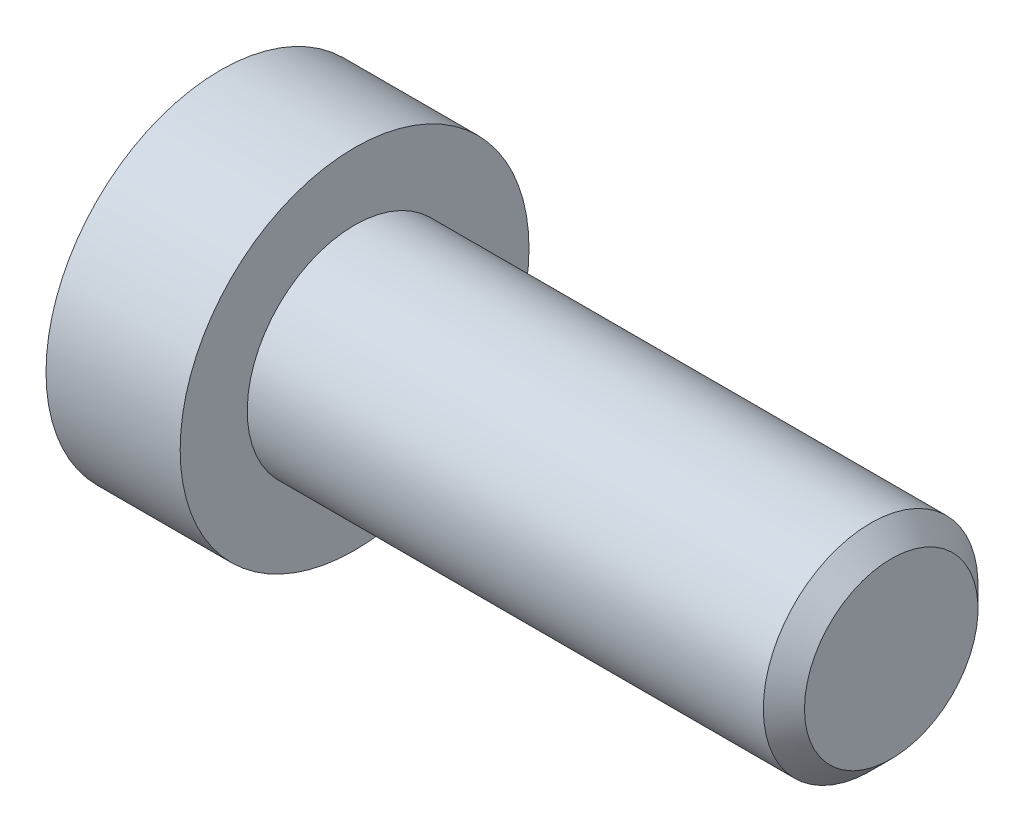
ISO-10303-21;
HEADER;
FILE_DESCRIPTION(('STEP AP214'),'2;1');
FILE_NAME('part.step','',(''),(''),'','','');
FILE_SCHEMA(('AUTOMOTIVE_DESIGN { 1 0 10303 214 1 1 1 1 }'));
ENDSEC;
DATA;
#1=APPLICATION_CONTEXT('core data for automotive mechanical design processes');
#2=APPLICATION_PROTOCOL_DEFINITION('international standard','automotive_design',2000,#1);
#3=PRODUCT_CONTEXT('',#1,'mechanical');
#4=PRODUCT('Part','Part','',(#3));
#5=PRODUCT_RELATED_PRODUCT_CATEGORY('part','',(#4));
#6=PRODUCT_DEFINITION_FORMATION('','',#4);
#7=PRODUCT_DEFINITION_CONTEXT('part definition',#1,'design');
#8=PRODUCT_DEFINITION('design','',#6,#7);
#9=PRODUCT_DEFINITION_SHAPE('','',#8);
#10=(LENGTH_UNIT() NAMED_UNIT(*) SI_UNIT(.MILLI.,.METRE.));
#11=(NAMED_UNIT(*) PLANE_ANGLE_UNIT() SI_UNIT($,.RADIAN.));
#12=(NAMED_UNIT(*) SI_UNIT($,.STERADIAN.) SOLID_ANGLE_UNIT());
#13=UNCERTAINTY_MEASURE_WITH_UNIT(LENGTH_MEASURE(1.E-05),#10,'distance_accuracy_value','');
#14=(GEOMETRIC_REPRESENTATION_CONTEXT(3) GLOBAL_UNCERTAINTY_ASSIGNED_CONTEXT((#13)) GLOBAL_UNIT_ASSIGNED_CONTEXT((#10,
#11,#12)) REPRESENTATION_CONTEXT('',''));
#15=CARTESIAN_POINT('',(0.,0.,0.));
#16=DIRECTION('',(0.,0.,1.));
#17=DIRECTION('',(1.,0.,0.));
#18=AXIS2_PLACEMENT_3D('',#15,#16,#17);
#19=CARTESIAN_POINT('',(1.4999999988845,0.,0.));
#20=DIRECTION('',(-1.,0.,0.));
#21=DIRECTION('',(0.,0.,1.));
#22=AXIS2_PLACEMENT_3D('',#19,#20,#21);
#23=CONICAL_SURFACE('',#22,1.9999999991569,1.04719754988149);
#24=CARTESIAN_POINT('',(2.65470054000616,-1.13686837721616E-10,0.));
#25=VERTEX_POINT('',#24);
#26=VERTEX_LOOP('',#25);
#27=FACE_BOUND('',#26,.T.);
#28=CARTESIAN_POINT('',(1.50000000000001,0.,0.));
#29=DIRECTION('',(1.,0.,0.));
#30=DIRECTION('',(0.,1.,0.));
#31=AXIS2_PLACEMENT_3D('',#28,#29,#30);
#32=CIRCLE('',#31,2.);
#33=CARTESIAN_POINT('',(1.50000000000001,2.,0.));
#34=VERTEX_POINT('',#33);
#35=EDGE_CURVE('E102',#34,#34,#32,.F.);
#36=ORIENTED_EDGE('',*,*,#35,.T.);
#37=EDGE_LOOP('',(#36));
#38=FACE_BOUND('',#37,.T.);
#39=ADVANCED_FACE('F15',(#27,#38),#23,.F.);
#40=CARTESIAN_POINT('',(0.172649730810379,0.,0.));
#41=DIRECTION('',(1.,0.,0.));
#42=DIRECTION('',(0.,1.,0.));
#43=AXIS2_PLACEMENT_3D('',#40,#41,#42);
#44=CYLINDRICAL_SURFACE('',#43,2.);
#45=ORIENTED_EDGE('',*,*,#35,.F.);
#46=EDGE_LOOP('',(#45));
#47=FACE_BOUND('',#46,.T.);
#48=CARTESIAN_POINT('',(-1.15470053748368,0.,0.));
#49=DIRECTION('',(-1.,0.,0.));
#50=DIRECTION('',(0.,1.,0.));
#51=AXIS2_PLACEMENT_3D('',#48,#49,#50);
#52=CIRCLE('',#51,2.0000000004643);
#53=CARTESIAN_POINT('',(-1.15470053748368,2.0000000004643,0.));
#54=VERTEX_POINT('',#53);
#55=EDGE_CURVE('E83',#54,#54,#52,.T.);
#56=ORIENTED_EDGE('',*,*,#55,.T.);
#57=EDGE_LOOP('',(#56));
#58=FACE_BOUND('',#57,.T.);
#59=ADVANCED_FACE('F152',(#47,#58),#44,.F.);
#60=CARTESIAN_POINT('',(-2.00507179761189,0.,0.));
#61=DIRECTION('',(-1.,0.,0.));
#62=DIRECTION('',(0.,0.,1.));
#63=AXIS2_PLACEMENT_3D('',#60,#61,#62);
#64=CONICAL_SURFACE('',#63,3.47288622424458,1.04719755000354);
#65=ORIENTED_EDGE('',*,*,#55,.F.);
#66=EDGE_LOOP('',(#65));
#67=FACE_BOUND('',#66,.T.);
#68=CARTESIAN_POINT('',(-2.00000000094557,3.00000000021538,1.73205080729591));
#69=CARTESIAN_POINT('',(-1.9560433185987,3.00000000007736,1.57982452062542));
#70=CARTESIAN_POINT('',(-1.91606701648317,3.00000000002074,1.42628421881986));
#71=CARTESIAN_POINT('',(-1.84628958176838,2.99999999997923,1.11654516758433));
#72=CARTESIAN_POINT('',(-1.81651313108637,2.9999999999945,0.960340916482288));
#73=CARTESIAN_POINT('',(-1.77016393888024,3.00000000000537,0.649868175264092));
#74=CARTESIAN_POINT('',(-1.75328268182428,3.00000000000144,0.495647441977665));
#75=CARTESIAN_POINT('',(-1.73313375260222,2.99999999999858,0.186480694490325));
#76=CARTESIAN_POINT('',(-1.72984939137745,2.99999999999965,0.0315358032554302));
#77=CARTESIAN_POINT('',(-1.73669943570568,3.00000000000032,-0.257962103818241));
#78=CARTESIAN_POINT('',(-1.74515192833178,3.00000000000009,-0.392558561177158));
#79=CARTESIAN_POINT('',(-1.77193595166592,2.99999999999992,-0.660874623875168));
#80=CARTESIAN_POINT('',(-1.79027662278917,2.99999999999998,-0.794593301873308));
#81=CARTESIAN_POINT('',(-1.83612475075242,3.00000000000003,-1.06346212096512));
#82=CARTESIAN_POINT('',(-1.86382646413472,3.00000000000002,-1.19857825024739));
#83=CARTESIAN_POINT('',(-1.92669764219973,2.99999999999999,-1.46679583459464));
#84=CARTESIAN_POINT('',(-1.96185234414,2.99999999999998,-1.59990072318624));
#85=CARTESIAN_POINT('',(-2.00000000108562,3.00000000000001,-1.7320508072926));
#86=B_SPLINE_CURVE_WITH_KNOTS('',3,(#68,#69,#70,#71,#72,#73,#74,#75,#76,#77,#78,#79,#80,#81,#82,
#83,#84,#85),.UNSPECIFIED.,.F.,.F.,(4,2,2,2,2,2,2,2,4),(0.,0.475524017494202,0.952190725870323,
1.41706140966825,1.88136133388909,2.28556167425684,2.69013629076999,3.10368243361385,
3.51641695995043),.UNSPECIFIED.);
#87=CARTESIAN_POINT('',(-2.00000000107572,2.99999999986554,1.73205080749124));
#88=VERTEX_POINT('',#87);
#89=CARTESIAN_POINT('',(-2.00000000112055,3.,-1.73205080741361));
#90=VERTEX_POINT('',#89);
#91=EDGE_CURVE('E18',#88,#90,#86,.T.);
#92=ORIENTED_EDGE('',*,*,#91,.T.);
#93=CARTESIAN_POINT('',(-2.00000000094557,2.99999999987129,-1.73205080789188));
#94=CARTESIAN_POINT('',(-1.9560433185987,2.86816816842187,-1.80816395110759));
#95=CARTESIAN_POINT('',(-1.91606701648317,2.73519836652522,-1.88493410196134));
#96=CARTESIAN_POINT('',(-1.84628958176838,2.4669564795904,-2.03980362754315));
#97=CARTESIAN_POINT('',(-1.81651313108636,2.33167962996455,-2.11790575310741));
#98=CARTESIAN_POINT('',(-1.77016393888024,2.06280234889243,-2.27314212372592));
#99=CARTESIAN_POINT('',(-1.75328268182428,1.92924327607415,-2.35025249036572));
#100=CARTESIAN_POINT('',(-1.73313375260221,1.66149701874328,-2.50483586410692));
#101=CARTESIAN_POINT('',(-1.72984939137744,1.52731080674778,-2.58230830972529));
#102=CARTESIAN_POINT('',(-1.73669943570568,1.27659826487989,-2.7270572632627));
#103=CARTESIAN_POINT('',(-1.74515192833178,1.16003431354756,-2.79435549194197));
#104=CARTESIAN_POINT('',(-1.77193595166592,0.927665787007584,-2.92851352329083));
#105=CARTESIAN_POINT('',(-1.79027662278917,0.811862014900753,-2.99537286228995));
#106=CARTESIAN_POINT('',(-1.83612475075242,0.579014787281745,-3.1298072718359));
#107=CARTESIAN_POINT('',(-1.86382646413472,0.462000786862266,-3.19736533647702));
#108=CARTESIAN_POINT('',(-1.92669764219973,0.229717545075842,-3.33147412865063));
#109=CARTESIAN_POINT('',(-1.96185234414,0.114445330187611,-3.39802657294642));
#110=CARTESIAN_POINT('',(-2.00000000108561,2.3927004015334E-10,-3.46410161499961));
#111=B_SPLINE_CURVE_WITH_KNOTS('',3,(#93,#94,#95,#96,#97,#98,#99,#100,#101,#102,#103,#104,#105,
#106,#107,#108,#109,#110),.UNSPECIFIED.,.F.,.F.,(4,2,2,2,2,2,2,2,4),(0.,0.475524017494201,
0.952190725870324,1.41706140966825,1.88136133388909,2.28556167425684,2.69013629076999,
3.10368243361386,3.51641695995044),.UNSPECIFIED.);
#112=CARTESIAN_POINT('',(-2.00000000107572,0.,-3.46410161498249));
#113=VERTEX_POINT('',#112);
#114=EDGE_CURVE('E107',#90,#113,#111,.T.);
#115=ORIENTED_EDGE('',*,*,#114,.T.);
#116=CARTESIAN_POINT('',(-2.00000000094557,-3.44076775434898E-10,-3.46410161518779));
#117=CARTESIAN_POINT('',(-1.9560433185987,-0.131831831655481,-3.38798847173302));
#118=CARTESIAN_POINT('',(-1.91606701648317,-0.264801633495514,-3.31121832078121));
#119=CARTESIAN_POINT('',(-1.84628958176838,-0.533043520388816,-3.15634879512749));
#120=CARTESIAN_POINT('',(-1.81651313108636,-0.668320370029949,-3.0782466695897));
#121=CARTESIAN_POINT('',(-1.77016393888024,-0.937197651112932,-2.92301029899001));
#122=CARTESIAN_POINT('',(-1.75328268182428,-1.07075672392727,-2.84589993234339));
#123=CARTESIAN_POINT('',(-1.73313375260221,-1.33850298125529,-2.69131655859725));
#124=CARTESIAN_POINT('',(-1.72984939137744,-1.47268919325186,-2.61384411298073));
#125=CARTESIAN_POINT('',(-1.73669943570568,-1.72340173512042,-2.46909515944447));
#126=CARTESIAN_POINT('',(-1.74515192833178,-1.83996568645252,-2.40179693076482));
#127=CARTESIAN_POINT('',(-1.77193595166592,-2.07233421299233,-2.26763889941566));
#128=CARTESIAN_POINT('',(-1.79027662278916,-2.18813798509922,-2.20077956041665));
#129=CARTESIAN_POINT('',(-1.83612475075242,-2.42098521271828,-2.06634515087078));
#130=CARTESIAN_POINT('',(-1.86382646413472,-2.53799921313775,-1.99878708622963));
#131=CARTESIAN_POINT('',(-1.92669764219973,-2.77028245492415,-1.86467829405599));
#132=CARTESIAN_POINT('',(-1.96185234414,-2.88555466981237,-1.79812584976018));
#133=CARTESIAN_POINT('',(-2.00000000108561,-2.99999999976073,-1.73205080770702));
#134=B_SPLINE_CURVE_WITH_KNOTS('',3,(#116,#117,#118,#119,#120,#121,#122,#123,#124,#125,#126,
#127,#128,#129,#130,#131,#132,#133),.UNSPECIFIED.,.F.,.F.,(4,2,2,2,2,2,2,2,4),(0.,
0.475524017494202,0.952190725870323,1.41706140966825,1.88136133388909,2.28556167425684,
2.69013629076999,3.10368243361386,3.51641695995044),.UNSPECIFIED.);
#135=CARTESIAN_POINT('',(-2.00000000107572,-2.99999999986553,-1.73205080749124));
#136=VERTEX_POINT('',#135);
#137=EDGE_CURVE('E141',#113,#136,#134,.T.);
#138=ORIENTED_EDGE('',*,*,#137,.T.);
#139=CARTESIAN_POINT('',(-2.00000000094557,-3.00000000021537,-1.73205080729591));
#140=CARTESIAN_POINT('',(-1.9560433185987,-3.00000000007735,-1.57982452062543));
#141=CARTESIAN_POINT('',(-1.91606701648317,-3.00000000002073,-1.42628421881987));
#142=CARTESIAN_POINT('',(-1.84628958176838,-2.99999999997922,-1.11654516758434));
#143=CARTESIAN_POINT('',(-1.81651313108636,-2.9999999999945,-0.960340916482298));
#144=CARTESIAN_POINT('',(-1.77016393888024,-3.00000000000537,-0.649868175264101));
#145=CARTESIAN_POINT('',(-1.75328268182428,-3.00000000000143,-0.495647441977675));
#146=CARTESIAN_POINT('',(-1.73313375260221,-2.99999999999857,-0.186480694490335));
#147=CARTESIAN_POINT('',(-1.72984939137744,-2.99999999999964,-0.0315358032554405));
#148=CARTESIAN_POINT('',(-1.73669943570568,-3.00000000000031,0.257962103818231));
#149=CARTESIAN_POINT('',(-1.74515192833178,-3.00000000000008,0.392558561177148));
#150=CARTESIAN_POINT('',(-1.77193595166592,-2.99999999999992,0.66087462387516));
#151=CARTESIAN_POINT('',(-1.79027662278916,-2.99999999999998,0.794593301873301));
#152=CARTESIAN_POINT('',(-1.83612475075242,-3.00000000000002,1.06346212096511));
#153=CARTESIAN_POINT('',(-1.86382646413472,-3.00000000000001,1.19857825024739));
#154=CARTESIAN_POINT('',(-1.92669764219973,-2.99999999999999,1.46679583459464));
#155=CARTESIAN_POINT('',(-1.96185234414,-2.99999999999998,1.59990072318624));
#156=CARTESIAN_POINT('',(-2.00000000108561,-3.,1.7320508072926));
#157=B_SPLINE_CURVE_WITH_KNOTS('',3,(#139,#140,#141,#142,#143,#144,#145,#146,#147,#148,#149,
#150,#151,#152,#153,#154,#155,#156),.UNSPECIFIED.,.F.,.F.,(4,2,2,2,2,2,2,2,4),(0.,
0.475524017494202,0.952190725870323,1.41706140966825,1.88136133388909,2.28556167425684,
2.69013629076999,3.10368243361386,3.51641695995044),.UNSPECIFIED.);
#158=CARTESIAN_POINT('',(-2.00000000107572,-2.99999999986553,1.73205080749124));
#159=VERTEX_POINT('',#158);
#160=EDGE_CURVE('E165',#136,#159,#157,.T.);
#161=ORIENTED_EDGE('',*,*,#160,.T.);
#162=CARTESIAN_POINT('',(-2.00000000094557,-2.99999999987129,1.73205080789188));
#163=CARTESIAN_POINT('',(-1.9560433185987,-2.86816816842187,1.80816395110759));
#164=CARTESIAN_POINT('',(-1.91606701648317,-2.73519836652522,1.88493410196134));
#165=CARTESIAN_POINT('',(-1.84628958176838,-2.4669564795904,2.03980362754315));
#166=CARTESIAN_POINT('',(-1.81651313108636,-2.33167962996455,2.1179057531074));
#167=CARTESIAN_POINT('',(-1.77016393888024,-2.06280234889243,2.27314212372591));
#168=CARTESIAN_POINT('',(-1.75328268182428,-1.92924327607415,2.35025249036572));
#169=CARTESIAN_POINT('',(-1.73313375260221,-1.66149701874328,2.50483586410691));
#170=CARTESIAN_POINT('',(-1.72984939137744,-1.52731080674778,2.58230830972529));
#171=CARTESIAN_POINT('',(-1.73669943570568,-1.27659826487989,2.7270572632627));
#172=CARTESIAN_POINT('',(-1.74515192833178,-1.16003431354756,2.79435549194196));
#173=CARTESIAN_POINT('',(-1.77193595166592,-0.927665787007583,2.92851352329082));
#174=CARTESIAN_POINT('',(-1.79027662278917,-0.811862014900752,2.99537286228995));
#175=CARTESIAN_POINT('',(-1.83612475075242,-0.579014787281744,3.1298072718359));
#176=CARTESIAN_POINT('',(-1.86382646413472,-0.462000786862265,3.19736533647702));
#177=CARTESIAN_POINT('',(-1.92669764219973,-0.22971754507584,3.33147412865062));
#178=CARTESIAN_POINT('',(-1.96185234414,-0.114445330187609,3.39802657294641));
#179=CARTESIAN_POINT('',(-2.00000000108561,-2.3926765252975E-10,3.46410161499961));
#180=B_SPLINE_CURVE_WITH_KNOTS('',3,(#162,#163,#164,#165,#166,#167,#168,#169,#170,#171,#172,
#173,#174,#175,#176,#177,#178,#179),.UNSPECIFIED.,.F.,.F.,(4,2,2,2,2,2,2,2,4),(0.,
0.475524017494202,0.952190725870323,1.41706140966825,1.88136133388909,2.28556167425684,
2.69013629076999,3.10368243361386,3.51641695995044),.UNSPECIFIED.);
#181=CARTESIAN_POINT('',(-2.00000000107572,0.,3.46410161498249));
#182=VERTEX_POINT('',#181);
#183=EDGE_CURVE('E88',#159,#182,#180,.T.);
#184=ORIENTED_EDGE('',*,*,#183,.T.);
#185=CARTESIAN_POINT('',(-2.00000000094557,3.44078262044656E-10,3.46410161518779));
#186=CARTESIAN_POINT('',(-1.9560433185987,0.131831831655483,3.38798847173302));
#187=CARTESIAN_POINT('',(-1.91606701648317,0.264801633495515,3.3112183207812));
#188=CARTESIAN_POINT('',(-1.84628958176838,0.533043520388817,3.15634879512749));
#189=CARTESIAN_POINT('',(-1.81651313108636,0.668320370029949,3.0782466695897));
#190=CARTESIAN_POINT('',(-1.77016393888023,0.937197651112932,2.92301029899001));
#191=CARTESIAN_POINT('',(-1.75328268182428,1.07075672392727,2.84589993234339));
#192=CARTESIAN_POINT('',(-1.73313375260221,1.33850298125529,2.69131655859724));
#193=CARTESIAN_POINT('',(-1.72984939137744,1.47268919325186,2.61384411298072));
#194=CARTESIAN_POINT('',(-1.73669943570568,1.72340173512042,2.46909515944447));
#195=CARTESIAN_POINT('',(-1.74515192833178,1.83996568645252,2.40179693076481));
#196=CARTESIAN_POINT('',(-1.77193595166592,2.07233421299233,2.26763889941566));
#197=CARTESIAN_POINT('',(-1.79027662278916,2.18813798509922,2.20077956041664));
#198=CARTESIAN_POINT('',(-1.83612475075241,2.42098521271828,2.06634515087078));
#199=CARTESIAN_POINT('',(-1.86382646413472,2.53799921313775,1.99878708622963));
#200=CARTESIAN_POINT('',(-1.92669764219973,2.77028245492415,1.86467829405598));
#201=CARTESIAN_POINT('',(-1.96185234414,2.88555466981237,1.79812584976017));
#202=CARTESIAN_POINT('',(-2.00000000108561,2.99999999976074,1.73205080770701));
#203=B_SPLINE_CURVE_WITH_KNOTS('',3,(#185,#186,#187,#188,#189,#190,#191,#192,#193,#194,#195,
#196,#197,#198,#199,#200,#201,#202),.UNSPECIFIED.,.F.,.F.,(4,2,2,2,2,2,2,2,4),(0.,
0.475524017494201,0.952190725870322,1.41706140966825,1.88136133388909,2.28556167425684,
2.69013629076999,3.10368243361386,3.51641695995045),.UNSPECIFIED.);
#204=EDGE_CURVE('E85',#182,#88,#203,.T.);
#205=ORIENTED_EDGE('',*,*,#204,.T.);
#206=EDGE_LOOP('',(#92,#115,#138,#161,#184,#205));
#207=FACE_BOUND('',#206,.T.);
#208=ADVANCED_FACE('F86',(#67,#207),#64,.F.);
#209=CARTESIAN_POINT('',(-5.,3.00000000000001,1.73205080756887));
#210=DIRECTION('',(0.,1.,0.));
#211=DIRECTION('',(0.,0.,1.));
#212=AXIS2_PLACEMENT_3D('',#209,#210,#211);
#213=PLANE('',#212);
#214=DIRECTION('',(1.,0.,0.));
#215=VECTOR('',#214,1.);
#216=CARTESIAN_POINT('',(-5.,3.,1.73205080756887));
#217=LINE('',#216,#215);
#218=CARTESIAN_POINT('',(-5.,3.,1.73205080756887));
#219=VERTEX_POINT('',#218);
#220=EDGE_CURVE('E76',#88,#219,#217,.F.);
#221=ORIENTED_EDGE('',*,*,#220,.T.);
#222=DIRECTION('',(0.,0.,1.));
#223=VECTOR('',#222,1.);
#224=CARTESIAN_POINT('',(-5.,3.,0.));
#225=LINE('',#224,#223);
#226=CARTESIAN_POINT('',(-5.,3.,-1.73205080756888));
#227=VERTEX_POINT('',#226);
#228=EDGE_CURVE('E105',#227,#219,#225,.T.);
#229=ORIENTED_EDGE('',*,*,#228,.F.);
#230=DIRECTION('',(1.,0.,0.));
#231=VECTOR('',#230,1.);
#232=CARTESIAN_POINT('',(-5.,3.,-1.73205080756888));
#233=LINE('',#232,#231);
#234=EDGE_CURVE('E79',#227,#90,#233,.T.);
#235=ORIENTED_EDGE('',*,*,#234,.T.);
#236=ORIENTED_EDGE('',*,*,#91,.F.);
#237=EDGE_LOOP('',(#221,#229,#235,#236));
#238=FACE_BOUND('',#237,.T.);
#239=ADVANCED_FACE('F73',(#238),#213,.F.);
#240=CARTESIAN_POINT('',(-5.,0.,3.46410161513775));
#241=DIRECTION('',(0.,0.500000000000001,0.866025403784438));
#242=DIRECTION('',(0.,-0.866025403784438,0.500000000000001));
#243=AXIS2_PLACEMENT_3D('',#240,#241,#242);
#244=PLANE('',#243);
#245=DIRECTION('',(1.,0.,0.));
#246=VECTOR('',#245,1.);
#247=CARTESIAN_POINT('',(-5.,0.,3.46410161513775));
#248=LINE('',#247,#246);
#249=CARTESIAN_POINT('',(-5.,0.,3.46410161513775));
#250=VERTEX_POINT('',#249);
#251=EDGE_CURVE('E91',#182,#250,#248,.F.);
#252=ORIENTED_EDGE('',*,*,#251,.T.);
#253=DIRECTION('',(0.,-0.866025403784438,0.500000000000001));
#254=VECTOR('',#253,1.);
#255=CARTESIAN_POINT('',(-5.,3.00000000000001,1.73205080756887));
#256=LINE('',#255,#254);
#257=EDGE_CURVE('E94',#219,#250,#256,.T.);
#258=ORIENTED_EDGE('',*,*,#257,.F.);
#259=ORIENTED_EDGE('',*,*,#220,.F.);
#260=ORIENTED_EDGE('',*,*,#204,.F.);
#261=EDGE_LOOP('',(#252,#258,#259,#260));
#262=FACE_BOUND('',#261,.T.);
#263=ADVANCED_FACE('F92',(#262),#244,.F.);
#264=CARTESIAN_POINT('',(-5.,-3.,1.73205080756888));
#265=DIRECTION('',(0.,-0.5,0.866025403784439));
#266=DIRECTION('',(0.,-0.866025403784439,-0.5));
#267=AXIS2_PLACEMENT_3D('',#264,#265,#266);
#268=PLANE('',#267);
#269=DIRECTION('',(1.,0.,0.));
#270=VECTOR('',#269,1.);
#271=CARTESIAN_POINT('',(-5.,-3.,1.73205080756888));
#272=LINE('',#271,#270);
#273=CARTESIAN_POINT('',(-5.,-3.,1.73205080756888));
#274=VERTEX_POINT('',#273);
#275=EDGE_CURVE('E174',#159,#274,#272,.F.);
#276=ORIENTED_EDGE('',*,*,#275,.T.);
#277=DIRECTION('',(0.,-0.866025403784439,-0.5));
#278=VECTOR('',#277,1.);
#279=CARTESIAN_POINT('',(-5.,0.,3.46410161513775));
#280=LINE('',#279,#278);
#281=EDGE_CURVE('E118',#250,#274,#280,.T.);
#282=ORIENTED_EDGE('',*,*,#281,.F.);
#283=ORIENTED_EDGE('',*,*,#251,.F.);
#284=ORIENTED_EDGE('',*,*,#183,.F.);
#285=EDGE_LOOP('',(#276,#282,#283,#284));
#286=FACE_BOUND('',#285,.T.);
#287=ADVANCED_FACE('F175',(#286),#268,.F.);
#288=CARTESIAN_POINT('',(-5.,-3.,-1.73205080756888));
#289=DIRECTION('',(0.,-1.,0.));
#290=DIRECTION('',(0.,0.,-1.));
#291=AXIS2_PLACEMENT_3D('',#288,#289,#290);
#292=PLANE('',#291);
#293=DIRECTION('',(1.,0.,0.));
#294=VECTOR('',#293,1.);
#295=CARTESIAN_POINT('',(-5.,-3.,-1.73205080756888));
#296=LINE('',#295,#294);
#297=CARTESIAN_POINT('',(-5.,-3.,-1.73205080756888));
#298=VERTEX_POINT('',#297);
#299=EDGE_CURVE('E226',#136,#298,#296,.F.);
#300=ORIENTED_EDGE('',*,*,#299,.T.);
#301=DIRECTION('',(0.,0.,1.));
#302=VECTOR('',#301,1.);
#303=CARTESIAN_POINT('',(-5.,-3.,0.));
#304=LINE('',#303,#302);
#305=EDGE_CURVE('E115',#274,#298,#304,.F.);
#306=ORIENTED_EDGE('',*,*,#305,.F.);
#307=ORIENTED_EDGE('',*,*,#275,.F.);
#308=ORIENTED_EDGE('',*,*,#160,.F.);
#309=EDGE_LOOP('',(#300,#306,#307,#308));
#310=FACE_BOUND('',#309,.T.);
#311=ADVANCED_FACE('F178',(#310),#292,.F.);
#312=CARTESIAN_POINT('',(-5.,0.,-3.46410161513775));
#313=DIRECTION('',(0.,-0.5,-0.866025403784439));
#314=DIRECTION('',(0.,0.866025403784439,-0.5));
#315=AXIS2_PLACEMENT_3D('',#312,#313,#314);
#316=PLANE('',#315);
#317=DIRECTION('',(1.,0.,0.));
#318=VECTOR('',#317,1.);
#319=CARTESIAN_POINT('',(-5.,0.,-3.46410161513776));
#320=LINE('',#319,#318);
#321=CARTESIAN_POINT('',(-5.,0.,-3.46410161513776));
#322=VERTEX_POINT('',#321);
#323=EDGE_CURVE('E38',#113,#322,#320,.F.);
#324=ORIENTED_EDGE('',*,*,#323,.T.);
#325=DIRECTION('',(0.,0.866025403784439,-0.5));
#326=VECTOR('',#325,1.);
#327=CARTESIAN_POINT('',(-5.,-3.,-1.73205080756888));
#328=LINE('',#327,#326);
#329=EDGE_CURVE('E112',#298,#322,#328,.T.);
#330=ORIENTED_EDGE('',*,*,#329,.F.);
#331=ORIENTED_EDGE('',*,*,#299,.F.);
#332=ORIENTED_EDGE('',*,*,#137,.F.);
#333=EDGE_LOOP('',(#324,#330,#331,#332));
#334=FACE_BOUND('',#333,.T.);
#335=ADVANCED_FACE('F217',(#334),#316,.F.);
#336=CARTESIAN_POINT('',(-5.,3.,-1.73205080756888));
#337=DIRECTION('',(0.,0.5,-0.866025403784439));
#338=DIRECTION('',(0.,0.866025403784439,0.5));
#339=AXIS2_PLACEMENT_3D('',#336,#337,#338);
#340=PLANE('',#339);
#341=ORIENTED_EDGE('',*,*,#234,.F.);
#342=DIRECTION('',(0.,0.866025403784439,0.499999999999999));
#343=VECTOR('',#342,1.);
#344=CARTESIAN_POINT('',(-5.,0.,-3.46410161513775));
#345=LINE('',#344,#343);
#346=EDGE_CURVE('E108',#322,#227,#345,.T.);
#347=ORIENTED_EDGE('',*,*,#346,.F.);
#348=ORIENTED_EDGE('',*,*,#323,.F.);
#349=ORIENTED_EDGE('',*,*,#114,.F.);
#350=EDGE_LOOP('',(#341,#347,#348,#349));
#351=FACE_BOUND('',#350,.T.);
#352=ADVANCED_FACE('F147',(#351),#340,.F.);
#353=CARTESIAN_POINT('',(-5.,4.98205080756888,0.));
#354=DIRECTION('',(-1.,0.,0.));
#355=DIRECTION('',(0.,0.,1.));
#356=AXIS2_PLACEMENT_3D('',#353,#354,#355);
#357=PLANE('',#356);
#358=ORIENTED_EDGE('',*,*,#329,.T.);
#359=ORIENTED_EDGE('',*,*,#346,.T.);
#360=ORIENTED_EDGE('',*,*,#228,.T.);
#361=ORIENTED_EDGE('',*,*,#257,.T.);
#362=ORIENTED_EDGE('',*,*,#281,.T.);
#363=ORIENTED_EDGE('',*,*,#305,.T.);
#364=EDGE_LOOP('',(#358,#359,#360,#361,#362,#363));
#365=FACE_BOUND('',#364,.T.);
#366=CARTESIAN_POINT('',(-5.,0.,0.));
#367=DIRECTION('',(1.,0.,0.));
#368=DIRECTION('',(0.,1.,0.));
#369=AXIS2_PLACEMENT_3D('',#366,#367,#368);
#370=CIRCLE('',#369,6.5);
#371=CARTESIAN_POINT('',(-5.,6.5,0.));
#372=VERTEX_POINT('',#371);
#373=EDGE_CURVE('E111',#372,#372,#370,.T.);
#374=ORIENTED_EDGE('',*,*,#373,.F.);
#375=EDGE_LOOP('',(#374));
#376=FACE_BOUND('',#375,.T.);
#377=ADVANCED_FACE('F210',(#365,#376),#357,.T.);
#378=CARTESIAN_POINT('',(-2.5,0.,0.));
#379=DIRECTION('',(1.,0.,0.));
#380=DIRECTION('',(0.,1.,0.));
#381=AXIS2_PLACEMENT_3D('',#378,#379,#380);
#382=CYLINDRICAL_SURFACE('',#381,6.5);
#383=ORIENTED_EDGE('',*,*,#373,.T.);
#384=EDGE_LOOP('',(#383));
#385=FACE_BOUND('',#384,.T.);
#386=CARTESIAN_POINT('',(0.,0.,0.));
#387=DIRECTION('',(1.,0.,0.));
#388=DIRECTION('',(0.,1.,0.));
#389=AXIS2_PLACEMENT_3D('',#386,#387,#388);
#390=CIRCLE('',#389,6.5);
#391=CARTESIAN_POINT('',(0.,6.5,0.));
#392=VERTEX_POINT('',#391);
#393=EDGE_CURVE('E131',#392,#392,#390,.T.);
#394=ORIENTED_EDGE('',*,*,#393,.F.);
#395=EDGE_LOOP('',(#394));
#396=FACE_BOUND('',#395,.T.);
#397=ADVANCED_FACE('F207',(#385,#396),#382,.T.);
#398=CARTESIAN_POINT('',(20.,2.,0.));
#399=DIRECTION('',(1.,0.,0.));
#400=DIRECTION('',(0.,0.,-1.));
#401=AXIS2_PLACEMENT_3D('',#398,#399,#400);
#402=PLANE('',#401);
#403=CARTESIAN_POINT('',(20.0000000003797,0.,0.));
#404=DIRECTION('',(-1.,0.,0.));
#405=DIRECTION('',(0.,0.,1.));
#406=AXIS2_PLACEMENT_3D('',#403,#404,#405);
#407=CIRCLE('',#406,3.2331875003706);
#408=CARTESIAN_POINT('',(20.0000000003797,0.,3.2331875003706));
#409=VERTEX_POINT('',#408);
#410=EDGE_CURVE('E128',#409,#409,#407,.T.);
#411=ORIENTED_EDGE('',*,*,#410,.F.);
#412=EDGE_LOOP('',(#411));
#413=FACE_BOUND('',#412,.T.);
#414=ADVANCED_FACE('F203',(#413),#402,.T.);
#415=CARTESIAN_POINT('',(0.,5.25,0.));
#416=DIRECTION('',(1.,0.,0.));
#417=DIRECTION('',(0.,0.,-1.));
#418=AXIS2_PLACEMENT_3D('',#415,#416,#417);
#419=PLANE('',#418);
#420=CARTESIAN_POINT('',(0.,0.,0.));
#421=DIRECTION('',(1.,0.,0.));
#422=DIRECTION('',(0.,1.,0.));
#423=AXIS2_PLACEMENT_3D('',#420,#421,#422);
#424=CIRCLE('',#423,4.);
#425=CARTESIAN_POINT('',(0.,4.,0.));
#426=VERTEX_POINT('',#425);
#427=EDGE_CURVE('E29',#426,#426,#424,.T.);
#428=ORIENTED_EDGE('',*,*,#427,.F.);
#429=EDGE_LOOP('',(#428));
#430=FACE_BOUND('',#429,.T.);
#431=ORIENTED_EDGE('',*,*,#393,.T.);
#432=EDGE_LOOP('',(#431));
#433=FACE_BOUND('',#432,.T.);
#434=ADVANCED_FACE('F196',(#430,#433),#419,.T.);
#435=CARTESIAN_POINT('',(19.2331874997649,0.,0.));
#436=DIRECTION('',(-1.,0.,0.));
#437=DIRECTION('',(0.,0.,1.));
#438=AXIS2_PLACEMENT_3D('',#435,#436,#437);
#439=CONICAL_SURFACE('',#438,3.9999999996212,0.785398162507894);
#440=ORIENTED_EDGE('',*,*,#410,.T.);
#441=EDGE_LOOP('',(#440));
#442=FACE_BOUND('',#441,.T.);
#443=CARTESIAN_POINT('',(19.2331875,0.,0.));
#444=DIRECTION('',(1.,0.,0.));
#445=DIRECTION('',(0.,1.,0.));
#446=AXIS2_PLACEMENT_3D('',#443,#444,#445);
#447=CIRCLE('',#446,4.);
#448=CARTESIAN_POINT('',(19.2331875,4.,0.));
#449=VERTEX_POINT('',#448);
#450=EDGE_CURVE('E9',#449,#449,#447,.F.);
#451=ORIENTED_EDGE('',*,*,#450,.F.);
#452=EDGE_LOOP('',(#451));
#453=FACE_BOUND('',#452,.T.);
#454=ADVANCED_FACE('F189',(#442,#453),#439,.T.);
#455=CARTESIAN_POINT('',(10.,0.,0.));
#456=DIRECTION('',(1.,0.,0.));
#457=DIRECTION('',(0.,1.,0.));
#458=AXIS2_PLACEMENT_3D('',#455,#456,#457);
#459=CYLINDRICAL_SURFACE('',#458,4.);
#460=ORIENTED_EDGE('',*,*,#450,.T.);
#461=EDGE_LOOP('',(#460));
#462=FACE_BOUND('',#461,.T.);
#463=ORIENTED_EDGE('',*,*,#427,.T.);
#464=EDGE_LOOP('',(#463));
#465=FACE_BOUND('',#464,.T.);
#466=ADVANCED_FACE('F187',(#462,#465),#459,.T.);
#467=CLOSED_SHELL('',(#39,#59,#208,#239,#263,#287,#311,#335,#352,#377,#397,#414,#434,#454,#466));
#468=MANIFOLD_SOLID_BREP('B1',#467);
#469=ADVANCED_BREP_SHAPE_REPRESENTATION('',(#18,#468),#14);
#470=SHAPE_DEFINITION_REPRESENTATION(#9,#469);
ENDSEC;
END-ISO-10303-21;
